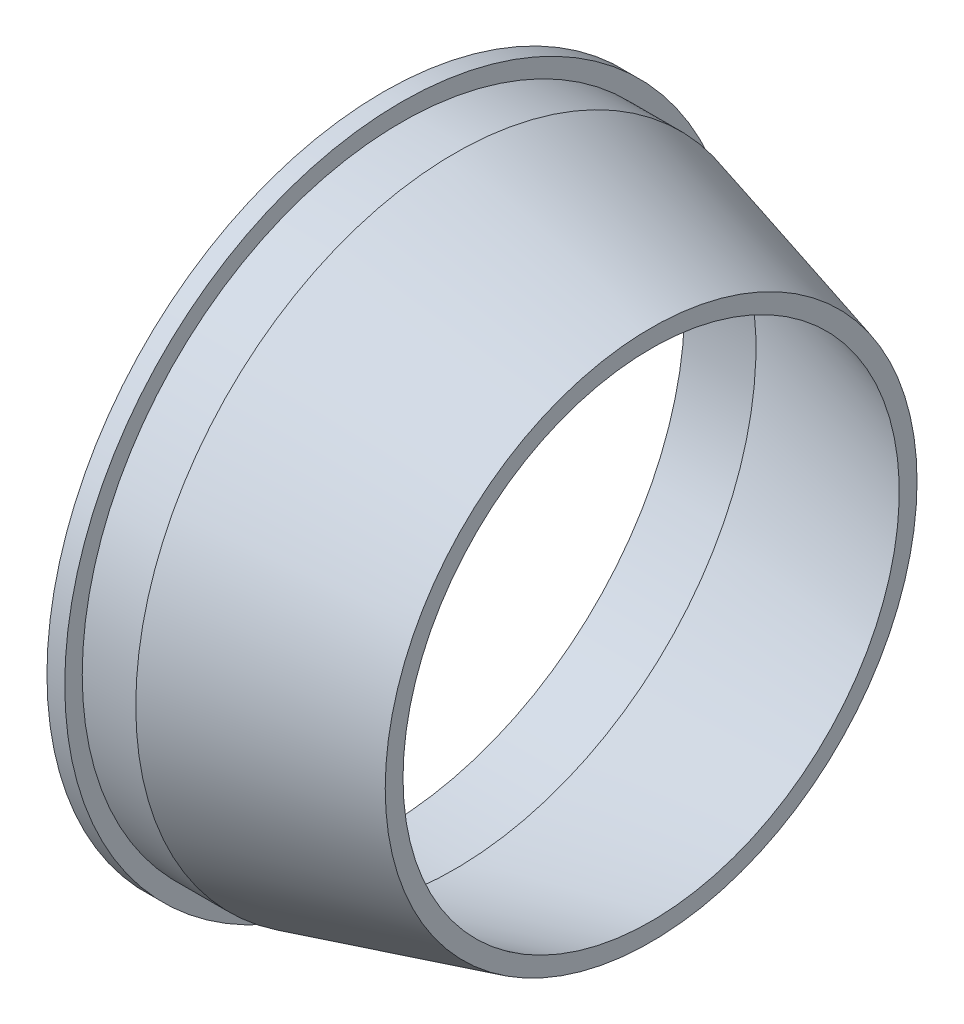
ISO-10303-21;
HEADER;
FILE_DESCRIPTION(('STEP AP214'),'2;1');
FILE_NAME('part.step','',(''),(''),'','','');
FILE_SCHEMA(('AUTOMOTIVE_DESIGN { 1 0 10303 214 1 1 1 1 }'));
ENDSEC;
DATA;
#1=APPLICATION_CONTEXT('core data for automotive mechanical design processes');
#2=APPLICATION_PROTOCOL_DEFINITION('international standard','automotive_design',2000,#1);
#3=PRODUCT_CONTEXT('',#1,'mechanical');
#4=PRODUCT('Part','Part','',(#3));
#5=PRODUCT_RELATED_PRODUCT_CATEGORY('part','',(#4));
#6=PRODUCT_DEFINITION_FORMATION('','',#4);
#7=PRODUCT_DEFINITION_CONTEXT('part definition',#1,'design');
#8=PRODUCT_DEFINITION('design','',#6,#7);
#9=PRODUCT_DEFINITION_SHAPE('','',#8);
#10=(LENGTH_UNIT() NAMED_UNIT(*) SI_UNIT(.MILLI.,.METRE.));
#11=(NAMED_UNIT(*) PLANE_ANGLE_UNIT() SI_UNIT($,.RADIAN.));
#12=(NAMED_UNIT(*) SI_UNIT($,.STERADIAN.) SOLID_ANGLE_UNIT());
#13=UNCERTAINTY_MEASURE_WITH_UNIT(LENGTH_MEASURE(1.E-05),#10,'distance_accuracy_value','');
#14=(GEOMETRIC_REPRESENTATION_CONTEXT(3) GLOBAL_UNCERTAINTY_ASSIGNED_CONTEXT((#13)) GLOBAL_UNIT_ASSIGNED_CONTEXT((#10,
#11,#12)) REPRESENTATION_CONTEXT('',''));
#15=CARTESIAN_POINT('',(0.,0.,0.));
#16=DIRECTION('',(0.,0.,1.));
#17=DIRECTION('',(1.,0.,0.));
#18=AXIS2_PLACEMENT_3D('',#15,#16,#17);
#19=CARTESIAN_POINT('',(0.,0.,0.));
#20=DIRECTION('',(-1.,0.,0.));
#21=DIRECTION('',(0.,0.,1.));
#22=AXIS2_PLACEMENT_3D('',#19,#20,#21);
#23=CYLINDRICAL_SURFACE('',#22,45.);
#24=CARTESIAN_POINT('',(10.66,0.,0.));
#25=DIRECTION('',(-1.,0.,0.));
#26=DIRECTION('',(0.,0.,1.));
#27=AXIS2_PLACEMENT_3D('',#24,#25,#26);
#28=CIRCLE('',#27,45.);
#29=CARTESIAN_POINT('',(10.66,0.,45.));
#30=VERTEX_POINT('',#29);
#31=EDGE_CURVE('E63',#30,#30,#28,.T.);
#32=ORIENTED_EDGE('',*,*,#31,.F.);
#33=EDGE_LOOP('',(#32));
#34=FACE_BOUND('',#33,.T.);
#35=CARTESIAN_POINT('',(0.,0.,0.));
#36=DIRECTION('',(-1.,0.,0.));
#37=DIRECTION('',(0.,0.,1.));
#38=AXIS2_PLACEMENT_3D('',#35,#36,#37);
#39=CIRCLE('',#38,45.);
#40=CARTESIAN_POINT('',(0.,0.,45.));
#41=VERTEX_POINT('',#40);
#42=EDGE_CURVE('E10',#41,#41,#39,.T.);
#43=ORIENTED_EDGE('',*,*,#42,.T.);
#44=EDGE_LOOP('',(#43));
#45=FACE_BOUND('',#44,.T.);
#46=ADVANCED_FACE('F35',(#34,#45),#23,.F.);
#47=CARTESIAN_POINT('',(0.,45.,0.));
#48=DIRECTION('',(1.,0.,0.));
#49=DIRECTION('',(0.,0.,-1.));
#50=AXIS2_PLACEMENT_3D('',#47,#48,#49);
#51=PLANE('',#50);
#52=CARTESIAN_POINT('',(0.,-46.5,0.));
#53=DIRECTION('',(-1.,0.,0.));
#54=DIRECTION('',(0.,0.,1.));
#55=AXIS2_PLACEMENT_3D('',#52,#53,#54);
#56=CIRCLE('',#55,1.);
#57=CARTESIAN_POINT('',(0.,-46.5,1.));
#58=VERTEX_POINT('',#57);
#59=EDGE_CURVE('E85',#58,#58,#56,.T.);
#60=ORIENTED_EDGE('',*,*,#59,.F.);
#61=EDGE_LOOP('',(#60));
#62=FACE_BOUND('',#61,.T.);
#63=CARTESIAN_POINT('',(0.,1.62353882256206E-13,-46.5));
#64=DIRECTION('',(-1.,0.,0.));
#65=DIRECTION('',(0.,0.,1.));
#66=AXIS2_PLACEMENT_3D('',#63,#64,#65);
#67=CIRCLE('',#66,0.999999999999998);
#68=CARTESIAN_POINT('',(0.,1.62353882256206E-13,-45.5));
#69=VERTEX_POINT('',#68);
#70=EDGE_CURVE('E82',#69,#69,#67,.T.);
#71=ORIENTED_EDGE('',*,*,#70,.F.);
#72=EDGE_LOOP('',(#71));
#73=FACE_BOUND('',#72,.T.);
#74=CARTESIAN_POINT('',(0.,46.5,3.24707764512411E-13));
#75=DIRECTION('',(-1.,0.,0.));
#76=DIRECTION('',(0.,0.,1.));
#77=AXIS2_PLACEMENT_3D('',#74,#75,#76);
#78=CIRCLE('',#77,1.);
#79=CARTESIAN_POINT('',(0.,46.5,1.00000000000032));
#80=VERTEX_POINT('',#79);
#81=EDGE_CURVE('E76',#80,#80,#78,.T.);
#82=ORIENTED_EDGE('',*,*,#81,.F.);
#83=EDGE_LOOP('',(#82));
#84=FACE_BOUND('',#83,.T.);
#85=CARTESIAN_POINT('',(0.,-4.87061646768617E-13,46.5));
#86=DIRECTION('',(-1.,0.,0.));
#87=DIRECTION('',(0.,0.,1.));
#88=AXIS2_PLACEMENT_3D('',#85,#86,#87);
#89=CIRCLE('',#88,0.999999999999998);
#90=CARTESIAN_POINT('',(0.,-4.87061646768617E-13,47.5));
#91=VERTEX_POINT('',#90);
#92=EDGE_CURVE('E70',#91,#91,#89,.T.);
#93=ORIENTED_EDGE('',*,*,#92,.F.);
#94=EDGE_LOOP('',(#93));
#95=FACE_BOUND('',#94,.T.);
#96=ORIENTED_EDGE('',*,*,#42,.F.);
#97=EDGE_LOOP('',(#96));
#98=FACE_BOUND('',#97,.T.);
#99=CARTESIAN_POINT('',(0.,0.,0.));
#100=DIRECTION('',(-1.,0.,0.));
#101=DIRECTION('',(0.,0.,1.));
#102=AXIS2_PLACEMENT_3D('',#99,#100,#101);
#103=CIRCLE('',#102,50.2711496746204);
#104=CARTESIAN_POINT('',(0.,0.,50.2711496746204));
#105=VERTEX_POINT('',#104);
#106=EDGE_CURVE('E41',#105,#105,#103,.T.);
#107=ORIENTED_EDGE('',*,*,#106,.T.);
#108=EDGE_LOOP('',(#107));
#109=FACE_BOUND('',#108,.T.);
#110=ADVANCED_FACE('F100',(#62,#73,#84,#95,#98,#109),#51,.F.);
#111=CARTESIAN_POINT('',(0.,0.,0.));
#112=DIRECTION('',(-1.,0.,0.));
#113=DIRECTION('',(0.,0.,1.));
#114=AXIS2_PLACEMENT_3D('',#111,#112,#113);
#115=CYLINDRICAL_SURFACE('',#114,50.2711496746204);
#116=ORIENTED_EDGE('',*,*,#106,.F.);
#117=EDGE_LOOP('',(#116));
#118=FACE_BOUND('',#117,.T.);
#119=CARTESIAN_POINT('',(2.66,0.,0.));
#120=DIRECTION('',(-1.,0.,0.));
#121=DIRECTION('',(0.,0.,1.));
#122=AXIS2_PLACEMENT_3D('',#119,#120,#121);
#123=CIRCLE('',#122,50.2711496746204);
#124=CARTESIAN_POINT('',(2.66,0.,50.2711496746204));
#125=VERTEX_POINT('',#124);
#126=EDGE_CURVE('E45',#125,#125,#123,.T.);
#127=ORIENTED_EDGE('',*,*,#126,.T.);
#128=EDGE_LOOP('',(#127));
#129=FACE_BOUND('',#128,.T.);
#130=ADVANCED_FACE('F103',(#118,#129),#115,.T.);
#131=CARTESIAN_POINT('',(2.66,50.2711496746204,0.));
#132=DIRECTION('',(-1.,0.,0.));
#133=DIRECTION('',(0.,0.,1.));
#134=AXIS2_PLACEMENT_3D('',#131,#132,#133);
#135=PLANE('',#134);
#136=ORIENTED_EDGE('',*,*,#126,.F.);
#137=EDGE_LOOP('',(#136));
#138=FACE_BOUND('',#137,.T.);
#139=CARTESIAN_POINT('',(2.66,0.,0.));
#140=DIRECTION('',(-1.,0.,0.));
#141=DIRECTION('',(0.,0.,1.));
#142=AXIS2_PLACEMENT_3D('',#139,#140,#141);
#143=CIRCLE('',#142,47.66);
#144=CARTESIAN_POINT('',(2.66,0.,47.66));
#145=VERTEX_POINT('',#144);
#146=EDGE_CURVE('E49',#145,#145,#143,.T.);
#147=ORIENTED_EDGE('',*,*,#146,.T.);
#148=EDGE_LOOP('',(#147));
#149=FACE_BOUND('',#148,.T.);
#150=ADVANCED_FACE('F146',(#138,#149),#135,.F.);
#151=CARTESIAN_POINT('',(0.,0.,0.));
#152=DIRECTION('',(-1.,0.,0.));
#153=DIRECTION('',(0.,0.,1.));
#154=AXIS2_PLACEMENT_3D('',#151,#152,#153);
#155=CYLINDRICAL_SURFACE('',#154,47.66);
#156=ORIENTED_EDGE('',*,*,#146,.F.);
#157=EDGE_LOOP('',(#156));
#158=FACE_BOUND('',#157,.T.);
#159=CARTESIAN_POINT('',(10.66,0.,0.));
#160=DIRECTION('',(-1.,0.,0.));
#161=DIRECTION('',(0.,0.,1.));
#162=AXIS2_PLACEMENT_3D('',#159,#160,#161);
#163=CIRCLE('',#162,47.66);
#164=CARTESIAN_POINT('',(10.66,0.,47.66));
#165=VERTEX_POINT('',#164);
#166=EDGE_CURVE('E54',#165,#165,#163,.T.);
#167=ORIENTED_EDGE('',*,*,#166,.T.);
#168=EDGE_LOOP('',(#167));
#169=FACE_BOUND('',#168,.T.);
#170=ADVANCED_FACE('F154',(#158,#169),#155,.T.);
#171=CARTESIAN_POINT('',(40.,0.,0.));
#172=DIRECTION('',(-1.,0.,0.));
#173=DIRECTION('',(0.,0.,1.));
#174=AXIS2_PLACEMENT_3D('',#171,#172,#173);
#175=CONICAL_SURFACE('',#174,39.7310244523204,0.263939768384598);
#176=ORIENTED_EDGE('',*,*,#166,.F.);
#177=EDGE_LOOP('',(#176));
#178=FACE_BOUND('',#177,.T.);
#179=CARTESIAN_POINT('',(40.,0.,0.));
#180=DIRECTION('',(-1.,0.,0.));
#181=DIRECTION('',(0.,0.,1.));
#182=AXIS2_PLACEMENT_3D('',#179,#180,#181);
#183=CIRCLE('',#182,39.7310244523204);
#184=CARTESIAN_POINT('',(40.,0.,39.7310244523204));
#185=VERTEX_POINT('',#184);
#186=EDGE_CURVE('E57',#185,#185,#183,.T.);
#187=ORIENTED_EDGE('',*,*,#186,.T.);
#188=EDGE_LOOP('',(#187));
#189=FACE_BOUND('',#188,.T.);
#190=ADVANCED_FACE('F162',(#178,#189),#175,.T.);
#191=CARTESIAN_POINT('',(40.,39.7310244523204,0.));
#192=DIRECTION('',(-1.,0.,0.));
#193=DIRECTION('',(0.,0.,1.));
#194=AXIS2_PLACEMENT_3D('',#191,#192,#193);
#195=PLANE('',#194);
#196=ORIENTED_EDGE('',*,*,#186,.F.);
#197=EDGE_LOOP('',(#196));
#198=FACE_BOUND('',#197,.T.);
#199=CARTESIAN_POINT('',(40.,0.,0.));
#200=DIRECTION('',(-1.,0.,0.));
#201=DIRECTION('',(0.,0.,1.));
#202=AXIS2_PLACEMENT_3D('',#199,#200,#201);
#203=CIRCLE('',#202,37.0710244523204);
#204=CARTESIAN_POINT('',(40.,0.,37.0710244523204));
#205=VERTEX_POINT('',#204);
#206=EDGE_CURVE('E60',#205,#205,#203,.T.);
#207=ORIENTED_EDGE('',*,*,#206,.T.);
#208=EDGE_LOOP('',(#207));
#209=FACE_BOUND('',#208,.T.);
#210=ADVANCED_FACE('F124',(#198,#209),#195,.F.);
#211=CARTESIAN_POINT('',(10.66,0.,0.));
#212=DIRECTION('',(-1.,0.,0.));
#213=DIRECTION('',(0.,0.,1.));
#214=AXIS2_PLACEMENT_3D('',#211,#212,#213);
#215=CONICAL_SURFACE('',#214,45.,0.263939768384598);
#216=ORIENTED_EDGE('',*,*,#206,.F.);
#217=EDGE_LOOP('',(#216));
#218=FACE_BOUND('',#217,.T.);
#219=ORIENTED_EDGE('',*,*,#31,.T.);
#220=EDGE_LOOP('',(#219));
#221=FACE_BOUND('',#220,.T.);
#222=ADVANCED_FACE('F114',(#218,#221),#215,.F.);
#223=CARTESIAN_POINT('',(10.,-4.87061646768617E-13,46.5));
#224=DIRECTION('',(-1.,0.,0.));
#225=DIRECTION('',(0.,0.,1.));
#226=AXIS2_PLACEMENT_3D('',#223,#224,#225);
#227=CYLINDRICAL_SURFACE('',#226,0.999999999999998);
#228=CARTESIAN_POINT('',(10.,-4.87061646768617E-13,46.5));
#229=DIRECTION('',(-1.,0.,0.));
#230=DIRECTION('',(0.,0.,1.));
#231=AXIS2_PLACEMENT_3D('',#228,#229,#230);
#232=CIRCLE('',#231,0.999999999999998);
#233=CARTESIAN_POINT('',(10.,-4.87061646768617E-13,47.5));
#234=VERTEX_POINT('',#233);
#235=EDGE_CURVE('E67',#234,#234,#232,.T.);
#236=ORIENTED_EDGE('',*,*,#235,.F.);
#237=EDGE_LOOP('',(#236));
#238=FACE_BOUND('',#237,.T.);
#239=ORIENTED_EDGE('',*,*,#92,.T.);
#240=EDGE_LOOP('',(#239));
#241=FACE_BOUND('',#240,.T.);
#242=ADVANCED_FACE('F111',(#238,#241),#227,.F.);
#243=CARTESIAN_POINT('',(10.,-4.87061646768617E-13,46.5));
#244=DIRECTION('',(-1.,0.,0.));
#245=DIRECTION('',(0.,0.,1.));
#246=AXIS2_PLACEMENT_3D('',#243,#244,#245);
#247=PLANE('',#246);
#248=ORIENTED_EDGE('',*,*,#235,.T.);
#249=EDGE_LOOP('',(#248));
#250=FACE_BOUND('',#249,.T.);
#251=ADVANCED_FACE('F113',(#250),#247,.T.);
#252=CARTESIAN_POINT('',(10.,46.5,3.24707764512411E-13));
#253=DIRECTION('',(-1.,0.,0.));
#254=DIRECTION('',(0.,0.,1.));
#255=AXIS2_PLACEMENT_3D('',#252,#253,#254);
#256=CYLINDRICAL_SURFACE('',#255,1.);
#257=CARTESIAN_POINT('',(10.,46.5,3.24707764512411E-13));
#258=DIRECTION('',(-1.,0.,0.));
#259=DIRECTION('',(0.,0.,1.));
#260=AXIS2_PLACEMENT_3D('',#257,#258,#259);
#261=CIRCLE('',#260,1.);
#262=CARTESIAN_POINT('',(10.,46.5,1.00000000000032));
#263=VERTEX_POINT('',#262);
#264=EDGE_CURVE('E73',#263,#263,#261,.T.);
#265=ORIENTED_EDGE('',*,*,#264,.F.);
#266=EDGE_LOOP('',(#265));
#267=FACE_BOUND('',#266,.T.);
#268=ORIENTED_EDGE('',*,*,#81,.T.);
#269=EDGE_LOOP('',(#268));
#270=FACE_BOUND('',#269,.T.);
#271=ADVANCED_FACE('F121',(#267,#270),#256,.F.);
#272=CARTESIAN_POINT('',(10.,46.5,3.24707764512411E-13));
#273=DIRECTION('',(-1.,0.,0.));
#274=DIRECTION('',(0.,0.,1.));
#275=AXIS2_PLACEMENT_3D('',#272,#273,#274);
#276=PLANE('',#275);
#277=ORIENTED_EDGE('',*,*,#264,.T.);
#278=EDGE_LOOP('',(#277));
#279=FACE_BOUND('',#278,.T.);
#280=ADVANCED_FACE('F210',(#279),#276,.T.);
#281=CARTESIAN_POINT('',(10.,1.62353882256206E-13,-46.5));
#282=DIRECTION('',(-1.,0.,0.));
#283=DIRECTION('',(0.,0.,1.));
#284=AXIS2_PLACEMENT_3D('',#281,#282,#283);
#285=CYLINDRICAL_SURFACE('',#284,0.999999999999998);
#286=CARTESIAN_POINT('',(10.,1.62353882256206E-13,-46.5));
#287=DIRECTION('',(-1.,0.,0.));
#288=DIRECTION('',(0.,0.,1.));
#289=AXIS2_PLACEMENT_3D('',#286,#287,#288);
#290=CIRCLE('',#289,0.999999999999998);
#291=CARTESIAN_POINT('',(10.,1.62353882256206E-13,-45.5));
#292=VERTEX_POINT('',#291);
#293=EDGE_CURVE('E79',#292,#292,#290,.T.);
#294=ORIENTED_EDGE('',*,*,#293,.F.);
#295=EDGE_LOOP('',(#294));
#296=FACE_BOUND('',#295,.T.);
#297=ORIENTED_EDGE('',*,*,#70,.T.);
#298=EDGE_LOOP('',(#297));
#299=FACE_BOUND('',#298,.T.);
#300=ADVANCED_FACE('F221',(#296,#299),#285,.F.);
#301=CARTESIAN_POINT('',(10.,1.62353882256206E-13,-46.5));
#302=DIRECTION('',(-1.,0.,0.));
#303=DIRECTION('',(0.,0.,1.));
#304=AXIS2_PLACEMENT_3D('',#301,#302,#303);
#305=PLANE('',#304);
#306=ORIENTED_EDGE('',*,*,#293,.T.);
#307=EDGE_LOOP('',(#306));
#308=FACE_BOUND('',#307,.T.);
#309=ADVANCED_FACE('F96',(#308),#305,.T.);
#310=CARTESIAN_POINT('',(10.,-46.5,0.));
#311=DIRECTION('',(-1.,0.,0.));
#312=DIRECTION('',(0.,0.,1.));
#313=AXIS2_PLACEMENT_3D('',#310,#311,#312);
#314=CYLINDRICAL_SURFACE('',#313,1.);
#315=CARTESIAN_POINT('',(10.,-46.5,0.));
#316=DIRECTION('',(-1.,0.,0.));
#317=DIRECTION('',(0.,0.,1.));
#318=AXIS2_PLACEMENT_3D('',#315,#316,#317);
#319=CIRCLE('',#318,1.);
#320=CARTESIAN_POINT('',(10.,-46.5,1.));
#321=VERTEX_POINT('',#320);
#322=EDGE_CURVE('E66',#321,#321,#319,.T.);
#323=ORIENTED_EDGE('',*,*,#322,.F.);
#324=EDGE_LOOP('',(#323));
#325=FACE_BOUND('',#324,.T.);
#326=ORIENTED_EDGE('',*,*,#59,.T.);
#327=EDGE_LOOP('',(#326));
#328=FACE_BOUND('',#327,.T.);
#329=ADVANCED_FACE('F93',(#325,#328),#314,.F.);
#330=CARTESIAN_POINT('',(10.,-46.5,0.));
#331=DIRECTION('',(-1.,0.,0.));
#332=DIRECTION('',(0.,0.,1.));
#333=AXIS2_PLACEMENT_3D('',#330,#331,#332);
#334=PLANE('',#333);
#335=ORIENTED_EDGE('',*,*,#322,.T.);
#336=EDGE_LOOP('',(#335));
#337=FACE_BOUND('',#336,.T.);
#338=ADVANCED_FACE('F91',(#337),#334,.T.);
#339=CLOSED_SHELL('',(#46,#110,#130,#150,#170,#190,#210,#222,#242,#251,#271,#280,#300,#309,#329,#338));
#340=MANIFOLD_SOLID_BREP('B2',#339);
#341=ADVANCED_BREP_SHAPE_REPRESENTATION('',(#18,#340),#14);
#342=SHAPE_DEFINITION_REPRESENTATION(#9,#341);
ENDSEC;
END-ISO-10303-21;
